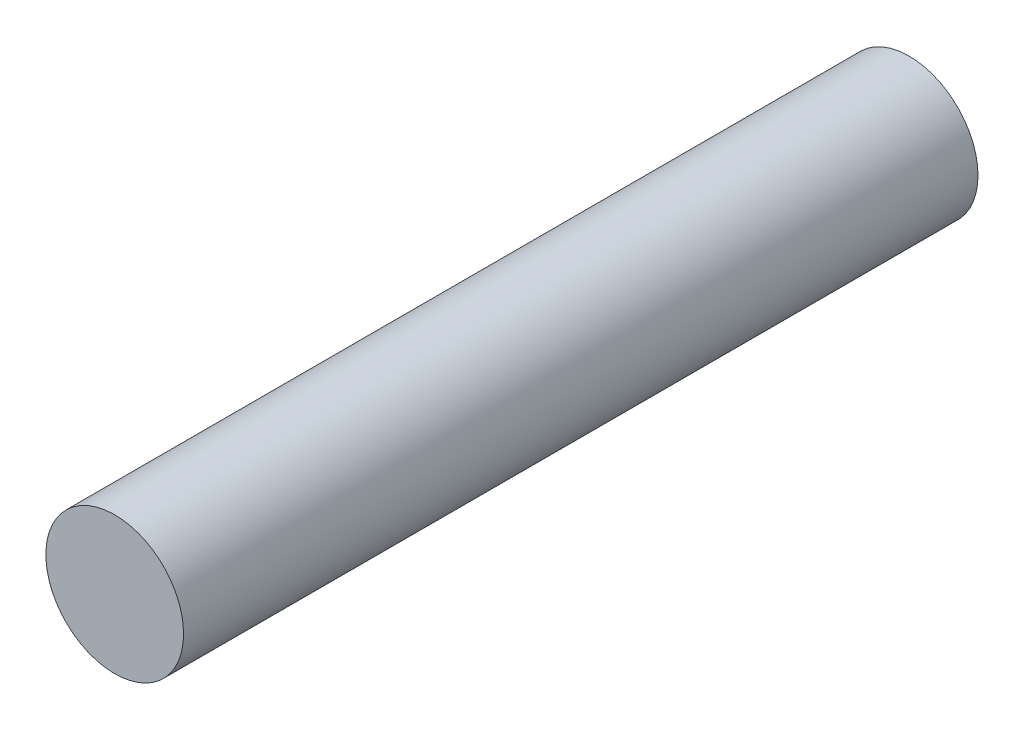
ISO-10303-21;
HEADER;
FILE_DESCRIPTION(('STEP AP214'),'2;1');
FILE_NAME('part.step','',(''),(''),'','','');
FILE_SCHEMA(('AUTOMOTIVE_DESIGN { 1 0 10303 214 1 1 1 1 }'));
ENDSEC;
DATA;
#1=APPLICATION_CONTEXT('core data for automotive mechanical design processes');
#2=APPLICATION_PROTOCOL_DEFINITION('international standard','automotive_design',2000,#1);
#3=PRODUCT_CONTEXT('',#1,'mechanical');
#4=PRODUCT('Part','Part','',(#3));
#5=PRODUCT_RELATED_PRODUCT_CATEGORY('part','',(#4));
#6=PRODUCT_DEFINITION_FORMATION('','',#4);
#7=PRODUCT_DEFINITION_CONTEXT('part definition',#1,'design');
#8=PRODUCT_DEFINITION('design','',#6,#7);
#9=PRODUCT_DEFINITION_SHAPE('','',#8);
#10=(LENGTH_UNIT() NAMED_UNIT(*) SI_UNIT(.MILLI.,.METRE.));
#11=(NAMED_UNIT(*) PLANE_ANGLE_UNIT() SI_UNIT($,.RADIAN.));
#12=(NAMED_UNIT(*) SI_UNIT($,.STERADIAN.) SOLID_ANGLE_UNIT());
#13=UNCERTAINTY_MEASURE_WITH_UNIT(LENGTH_MEASURE(1.E-05),#10,'distance_accuracy_value','');
#14=(GEOMETRIC_REPRESENTATION_CONTEXT(3) GLOBAL_UNCERTAINTY_ASSIGNED_CONTEXT((#13)) GLOBAL_UNIT_ASSIGNED_CONTEXT((#10,
#11,#12)) REPRESENTATION_CONTEXT('',''));
#15=CARTESIAN_POINT('',(0.,0.,0.));
#16=DIRECTION('',(0.,0.,1.));
#17=DIRECTION('',(1.,0.,0.));
#18=AXIS2_PLACEMENT_3D('',#15,#16,#17);
#19=CARTESIAN_POINT('',(0.,0.,37.5));
#20=DIRECTION('',(0.,0.,-1.));
#21=DIRECTION('',(-1.,0.,0.));
#22=AXIS2_PLACEMENT_3D('',#19,#20,#21);
#23=CYLINDRICAL_SURFACE('',#22,6.5);
#24=CARTESIAN_POINT('',(0.,0.,37.5));
#25=DIRECTION('',(0.,0.,1.));
#26=DIRECTION('',(1.,0.,0.));
#27=AXIS2_PLACEMENT_3D('',#24,#25,#26);
#28=CIRCLE('',#27,6.5);
#29=CARTESIAN_POINT('',(6.5,0.,37.5));
#30=VERTEX_POINT('',#29);
#31=EDGE_CURVE('E10',#30,#30,#28,.T.);
#32=ORIENTED_EDGE('',*,*,#31,.F.);
#33=EDGE_LOOP('',(#32));
#34=FACE_BOUND('',#33,.T.);
#35=CARTESIAN_POINT('',(0.,0.,-37.5));
#36=DIRECTION('',(0.,0.,1.));
#37=DIRECTION('',(1.,0.,0.));
#38=AXIS2_PLACEMENT_3D('',#35,#36,#37);
#39=CIRCLE('',#38,6.5);
#40=CARTESIAN_POINT('',(6.5,0.,-37.5));
#41=VERTEX_POINT('',#40);
#42=EDGE_CURVE('E33',#41,#41,#39,.T.);
#43=ORIENTED_EDGE('',*,*,#42,.T.);
#44=EDGE_LOOP('',(#43));
#45=FACE_BOUND('',#44,.T.);
#46=ADVANCED_FACE('F30',(#34,#45),#23,.T.);
#47=CARTESIAN_POINT('',(0.,0.,37.5));
#48=DIRECTION('',(0.,0.,1.));
#49=DIRECTION('',(1.,0.,0.));
#50=AXIS2_PLACEMENT_3D('',#47,#48,#49);
#51=PLANE('',#50);
#52=ORIENTED_EDGE('',*,*,#31,.T.);
#53=EDGE_LOOP('',(#52));
#54=FACE_BOUND('',#53,.T.);
#55=ADVANCED_FACE('F45',(#54),#51,.T.);
#56=CARTESIAN_POINT('',(0.,0.,-37.5));
#57=DIRECTION('',(0.,0.,1.));
#58=DIRECTION('',(1.,0.,0.));
#59=AXIS2_PLACEMENT_3D('',#56,#57,#58);
#60=PLANE('',#59);
#61=ORIENTED_EDGE('',*,*,#42,.F.);
#62=EDGE_LOOP('',(#61));
#63=FACE_BOUND('',#62,.T.);
#64=ADVANCED_FACE('F43',(#63),#60,.F.);
#65=CLOSED_SHELL('',(#46,#55,#64));
#66=MANIFOLD_SOLID_BREP('B2',#65);
#67=ADVANCED_BREP_SHAPE_REPRESENTATION('',(#18,#66),#14);
#68=SHAPE_DEFINITION_REPRESENTATION(#9,#67);
ENDSEC;
END-ISO-10303-21;
